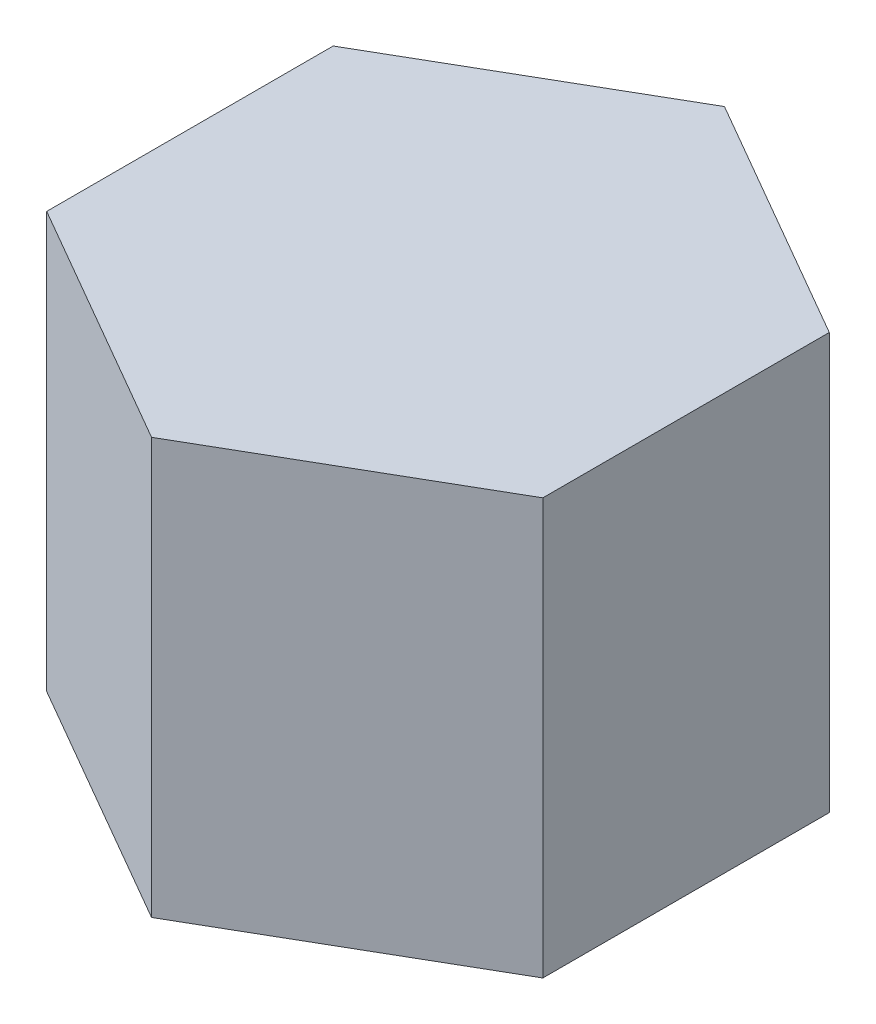
ISO-10303-21;
HEADER;
FILE_DESCRIPTION(('STEP AP214'),'2;1');
FILE_NAME('part.step','',(''),(''),'','','');
FILE_SCHEMA(('AUTOMOTIVE_DESIGN { 1 0 10303 214 1 1 1 1 }'));
ENDSEC;
DATA;
#1=APPLICATION_CONTEXT('core data for automotive mechanical design processes');
#2=APPLICATION_PROTOCOL_DEFINITION('international standard','automotive_design',2000,#1);
#3=PRODUCT_CONTEXT('',#1,'mechanical');
#4=PRODUCT('Part','Part','',(#3));
#5=PRODUCT_RELATED_PRODUCT_CATEGORY('part','',(#4));
#6=PRODUCT_DEFINITION_FORMATION('','',#4);
#7=PRODUCT_DEFINITION_CONTEXT('part definition',#1,'design');
#8=PRODUCT_DEFINITION('design','',#6,#7);
#9=PRODUCT_DEFINITION_SHAPE('','',#8);
#10=(LENGTH_UNIT() NAMED_UNIT(*) SI_UNIT(.MILLI.,.METRE.));
#11=(NAMED_UNIT(*) PLANE_ANGLE_UNIT() SI_UNIT($,.RADIAN.));
#12=(NAMED_UNIT(*) SI_UNIT($,.STERADIAN.) SOLID_ANGLE_UNIT());
#13=UNCERTAINTY_MEASURE_WITH_UNIT(LENGTH_MEASURE(1.E-05),#10,'distance_accuracy_value','');
#14=(GEOMETRIC_REPRESENTATION_CONTEXT(3) GLOBAL_UNCERTAINTY_ASSIGNED_CONTEXT((#13)) GLOBAL_UNIT_ASSIGNED_CONTEXT((#10,
#11,#12)) REPRESENTATION_CONTEXT('',''));
#15=CARTESIAN_POINT('',(0.,0.,0.));
#16=DIRECTION('',(0.,0.,1.));
#17=DIRECTION('',(1.,0.,0.));
#18=AXIS2_PLACEMENT_3D('',#15,#16,#17);
#19=CARTESIAN_POINT('',(210.142660308706,-148.537700895744,294.105047431848));
#20=DIRECTION('',(-0.499999999999909,0.,-0.866025403784491));
#21=DIRECTION('',(-0.866025403784491,0.,0.499999999999909));
#22=AXIS2_PLACEMENT_3D('',#19,#20,#21);
#23=PLANE('',#22);
#24=CARTESIAN_POINT('',(209.839551417381,-149.045793579175,294.280047431848));
#25=DIRECTION('',(0.866025403784491,0.,-0.499999999999909));
#26=VECTOR('',#25,1.);
#27=LINE('',#24,#26);
#28=CARTESIAN_POINT('',(209.839551417382,-149.045793579175,294.280047431848));
#29=VERTEX_POINT('',#28);
#30=CARTESIAN_POINT('',(210.142660308706,-149.045793579175,294.105047431848));
#31=VERTEX_POINT('',#30);
#32=EDGE_CURVE('E170',#29,#31,#27,.T.);
#33=ORIENTED_EDGE('',*,*,#32,.T.);
#34=CARTESIAN_POINT('',(210.142660308706,-148.537700895744,294.105047431848));
#35=DIRECTION('',(0.,-1.,0.));
#36=VECTOR('',#35,1.);
#37=LINE('',#34,#36);
#38=CARTESIAN_POINT('',(210.142660308706,-148.537700895744,294.105047431848));
#39=VERTEX_POINT('',#38);
#40=EDGE_CURVE('E35',#39,#31,#37,.T.);
#41=ORIENTED_EDGE('',*,*,#40,.F.);
#42=CARTESIAN_POINT('',(209.839551417381,-148.537700895744,294.280047431848));
#43=DIRECTION('',(0.866025403784491,0.,-0.499999999999909));
#44=VECTOR('',#43,1.);
#45=LINE('',#42,#44);
#46=CARTESIAN_POINT('',(209.839551417382,-148.537700895744,294.280047431848));
#47=VERTEX_POINT('',#46);
#48=EDGE_CURVE('E159',#47,#39,#45,.T.);
#49=ORIENTED_EDGE('',*,*,#48,.F.);
#50=CARTESIAN_POINT('',(209.839551417381,-148.537700895744,294.280047431848));
#51=DIRECTION('',(0.,-1.,0.));
#52=VECTOR('',#51,1.);
#53=LINE('',#50,#52);
#54=EDGE_CURVE('E10',#47,#29,#53,.T.);
#55=ORIENTED_EDGE('',*,*,#54,.T.);
#56=EDGE_LOOP('',(#33,#41,#49,#55));
#57=FACE_BOUND('',#56,.T.);
#58=ADVANCED_FACE('F16',(#57),#23,.F.);
#59=CARTESIAN_POINT('',(209.839551417382,-148.537700895744,294.280047431848));
#60=DIRECTION('',(0.500000000000096,0.,-0.866025403784383));
#61=DIRECTION('',(-0.866025403784383,0.,-0.500000000000096));
#62=AXIS2_PLACEMENT_3D('',#59,#60,#61);
#63=PLANE('',#62);
#64=CARTESIAN_POINT('',(209.536442526057,-149.045793579175,294.105047431848));
#65=DIRECTION('',(0.866025403784383,0.,0.500000000000096));
#66=VECTOR('',#65,1.);
#67=LINE('',#64,#66);
#68=CARTESIAN_POINT('',(209.536442526057,-149.045793579175,294.105047431848));
#69=VERTEX_POINT('',#68);
#70=EDGE_CURVE('E167',#69,#29,#67,.T.);
#71=ORIENTED_EDGE('',*,*,#70,.T.);
#72=ORIENTED_EDGE('',*,*,#54,.F.);
#73=CARTESIAN_POINT('',(209.536442526057,-148.537700895744,294.105047431848));
#74=DIRECTION('',(0.866025403784383,0.,0.500000000000096));
#75=VECTOR('',#74,1.);
#76=LINE('',#73,#75);
#77=CARTESIAN_POINT('',(209.536442526057,-148.537700895744,294.105047431848));
#78=VERTEX_POINT('',#77);
#79=EDGE_CURVE('E156',#78,#47,#76,.T.);
#80=ORIENTED_EDGE('',*,*,#79,.F.);
#81=CARTESIAN_POINT('',(209.536442526057,-148.537700895744,294.105047431848));
#82=DIRECTION('',(0.,-1.,0.));
#83=VECTOR('',#82,1.);
#84=LINE('',#81,#83);
#85=EDGE_CURVE('E27',#78,#69,#84,.T.);
#86=ORIENTED_EDGE('',*,*,#85,.T.);
#87=EDGE_LOOP('',(#71,#72,#80,#86));
#88=FACE_BOUND('',#87,.T.);
#89=ADVANCED_FACE('F189',(#88),#63,.F.);
#90=CARTESIAN_POINT('',(209.536442526057,-148.537700895744,290.831971220494));
#91=DIRECTION('',(1.,0.,0.));
#92=DIRECTION('',(0.,1.,0.));
#93=AXIS2_PLACEMENT_3D('',#90,#91,#92);
#94=PLANE('',#93);
#95=CARTESIAN_POINT('',(209.536442526057,-149.045793579175,293.755047431848));
#96=DIRECTION('',(0.,0.,1.));
#97=VECTOR('',#96,1.);
#98=LINE('',#95,#97);
#99=CARTESIAN_POINT('',(209.536442526057,-149.045793579175,293.755047431848));
#100=VERTEX_POINT('',#99);
#101=EDGE_CURVE('E163',#100,#69,#98,.T.);
#102=ORIENTED_EDGE('',*,*,#101,.T.);
#103=ORIENTED_EDGE('',*,*,#85,.F.);
#104=CARTESIAN_POINT('',(209.536442526057,-148.537700895744,293.755047431848));
#105=DIRECTION('',(0.,0.,1.));
#106=VECTOR('',#105,1.);
#107=LINE('',#104,#106);
#108=CARTESIAN_POINT('',(209.536442526057,-148.537700895744,293.755047431848));
#109=VERTEX_POINT('',#108);
#110=EDGE_CURVE('E106',#109,#78,#107,.T.);
#111=ORIENTED_EDGE('',*,*,#110,.F.);
#112=CARTESIAN_POINT('',(209.536442526057,-148.537700895744,293.755047431848));
#113=DIRECTION('',(0.,-1.,0.));
#114=VECTOR('',#113,1.);
#115=LINE('',#112,#114);
#116=EDGE_CURVE('E94',#109,#100,#115,.T.);
#117=ORIENTED_EDGE('',*,*,#116,.T.);
#118=EDGE_LOOP('',(#102,#103,#111,#117));
#119=FACE_BOUND('',#118,.T.);
#120=ADVANCED_FACE('F198',(#119),#94,.F.);
#121=CARTESIAN_POINT('',(209.536442526057,-148.537700895744,293.755047431848));
#122=DIRECTION('',(0.499999999999978,0.,0.866025403784452));
#123=DIRECTION('',(0.866025403784452,0.,-0.499999999999978));
#124=AXIS2_PLACEMENT_3D('',#121,#122,#123);
#125=PLANE('',#124);
#126=CARTESIAN_POINT('',(209.839551417382,-149.045793579175,293.580047431848));
#127=DIRECTION('',(-0.866025403784452,0.,0.499999999999978));
#128=VECTOR('',#127,1.);
#129=LINE('',#126,#128);
#130=CARTESIAN_POINT('',(209.839551417382,-149.045793579175,293.580047431848));
#131=VERTEX_POINT('',#130);
#132=EDGE_CURVE('E162',#131,#100,#129,.T.);
#133=ORIENTED_EDGE('',*,*,#132,.T.);
#134=ORIENTED_EDGE('',*,*,#116,.F.);
#135=CARTESIAN_POINT('',(209.839551417382,-148.537700895744,293.580047431848));
#136=DIRECTION('',(-0.866025403784452,0.,0.499999999999978));
#137=VECTOR('',#136,1.);
#138=LINE('',#135,#137);
#139=CARTESIAN_POINT('',(209.839551417382,-148.537700895744,293.580047431848));
#140=VERTEX_POINT('',#139);
#141=EDGE_CURVE('E98',#140,#109,#138,.T.);
#142=ORIENTED_EDGE('',*,*,#141,.F.);
#143=CARTESIAN_POINT('',(209.839551417382,-148.537700895744,293.580047431848));
#144=DIRECTION('',(0.,-1.,0.));
#145=VECTOR('',#144,1.);
#146=LINE('',#143,#145);
#147=EDGE_CURVE('E79',#140,#131,#146,.T.);
#148=ORIENTED_EDGE('',*,*,#147,.T.);
#149=EDGE_LOOP('',(#133,#134,#142,#148));
#150=FACE_BOUND('',#149,.T.);
#151=ADVANCED_FACE('F100',(#150),#125,.F.);
#152=CARTESIAN_POINT('',(209.839551417382,-148.537700895744,293.580047431848));
#153=DIRECTION('',(-0.500000000000062,0.,0.866025403784403));
#154=DIRECTION('',(0.866025403784403,0.,0.500000000000062));
#155=AXIS2_PLACEMENT_3D('',#152,#153,#154);
#156=PLANE('',#155);
#157=CARTESIAN_POINT('',(210.142660308706,-149.045793579175,293.755047431848));
#158=DIRECTION('',(-0.866025403784403,0.,-0.500000000000062));
#159=VECTOR('',#158,1.);
#160=LINE('',#157,#159);
#161=CARTESIAN_POINT('',(210.142660308706,-149.045793579175,293.755047431848));
#162=VERTEX_POINT('',#161);
#163=EDGE_CURVE('E88',#162,#131,#160,.T.);
#164=ORIENTED_EDGE('',*,*,#163,.T.);
#165=ORIENTED_EDGE('',*,*,#147,.F.);
#166=CARTESIAN_POINT('',(210.142660308706,-148.537700895744,293.755047431848));
#167=DIRECTION('',(-0.866025403784403,0.,-0.500000000000062));
#168=VECTOR('',#167,1.);
#169=LINE('',#166,#168);
#170=CARTESIAN_POINT('',(210.142660308706,-148.537700895744,293.755047431848));
#171=VERTEX_POINT('',#170);
#172=EDGE_CURVE('E84',#171,#140,#169,.T.);
#173=ORIENTED_EDGE('',*,*,#172,.F.);
#174=CARTESIAN_POINT('',(210.142660308706,-148.537700895744,293.755047431848));
#175=DIRECTION('',(0.,-1.,0.));
#176=VECTOR('',#175,1.);
#177=LINE('',#174,#176);
#178=EDGE_CURVE('E58',#171,#162,#177,.T.);
#179=ORIENTED_EDGE('',*,*,#178,.T.);
#180=EDGE_LOOP('',(#164,#165,#173,#179));
#181=FACE_BOUND('',#180,.T.);
#182=ADVANCED_FACE('F82',(#181),#156,.F.);
#183=CARTESIAN_POINT('',(210.142660308706,-148.537700895744,290.831971220494));
#184=DIRECTION('',(-1.,0.,0.));
#185=DIRECTION('',(0.,-1.,0.));
#186=AXIS2_PLACEMENT_3D('',#183,#184,#185);
#187=PLANE('',#186);
#188=CARTESIAN_POINT('',(210.142660308706,-149.045793579175,294.105047431848));
#189=DIRECTION('',(0.,0.,-1.));
#190=VECTOR('',#189,1.);
#191=LINE('',#188,#190);
#192=EDGE_CURVE('E160',#31,#162,#191,.T.);
#193=ORIENTED_EDGE('',*,*,#192,.T.);
#194=ORIENTED_EDGE('',*,*,#178,.F.);
#195=CARTESIAN_POINT('',(210.142660308706,-148.537700895744,294.105047431848));
#196=DIRECTION('',(0.,0.,-1.));
#197=VECTOR('',#196,1.);
#198=LINE('',#195,#197);
#199=EDGE_CURVE('E112',#39,#171,#198,.T.);
#200=ORIENTED_EDGE('',*,*,#199,.F.);
#201=ORIENTED_EDGE('',*,*,#40,.T.);
#202=EDGE_LOOP('',(#193,#194,#200,#201));
#203=FACE_BOUND('',#202,.T.);
#204=ADVANCED_FACE('F131',(#203),#187,.F.);
#205=CARTESIAN_POINT('',(206.339551417382,-148.537700895744,290.831971220494));
#206=DIRECTION('',(0.,-1.,0.));
#207=DIRECTION('',(1.,0.,0.));
#208=AXIS2_PLACEMENT_3D('',#205,#206,#207);
#209=PLANE('',#208);
#210=ORIENTED_EDGE('',*,*,#48,.T.);
#211=ORIENTED_EDGE('',*,*,#199,.T.);
#212=ORIENTED_EDGE('',*,*,#172,.T.);
#213=ORIENTED_EDGE('',*,*,#141,.T.);
#214=ORIENTED_EDGE('',*,*,#110,.T.);
#215=ORIENTED_EDGE('',*,*,#79,.T.);
#216=EDGE_LOOP('',(#210,#211,#212,#213,#214,#215));
#217=FACE_BOUND('',#216,.T.);
#218=ADVANCED_FACE('F111',(#217),#209,.F.);
#219=CARTESIAN_POINT('',(206.339551417382,-149.045793579175,290.831971220494));
#220=DIRECTION('',(0.,-1.,0.));
#221=DIRECTION('',(1.,0.,0.));
#222=AXIS2_PLACEMENT_3D('',#219,#220,#221);
#223=PLANE('',#222);
#224=ORIENTED_EDGE('',*,*,#32,.F.);
#225=ORIENTED_EDGE('',*,*,#70,.F.);
#226=ORIENTED_EDGE('',*,*,#101,.F.);
#227=ORIENTED_EDGE('',*,*,#132,.F.);
#228=ORIENTED_EDGE('',*,*,#163,.F.);
#229=ORIENTED_EDGE('',*,*,#192,.F.);
#230=EDGE_LOOP('',(#224,#225,#226,#227,#228,#229));
#231=FACE_BOUND('',#230,.T.);
#232=ADVANCED_FACE('F130',(#231),#223,.T.);
#233=CLOSED_SHELL('',(#58,#89,#120,#151,#182,#204,#218,#232));
#234=MANIFOLD_SOLID_BREP('B1',#233);
#235=ADVANCED_BREP_SHAPE_REPRESENTATION('',(#18,#234),#14);
#236=SHAPE_DEFINITION_REPRESENTATION(#9,#235);
ENDSEC;
END-ISO-10303-21;
